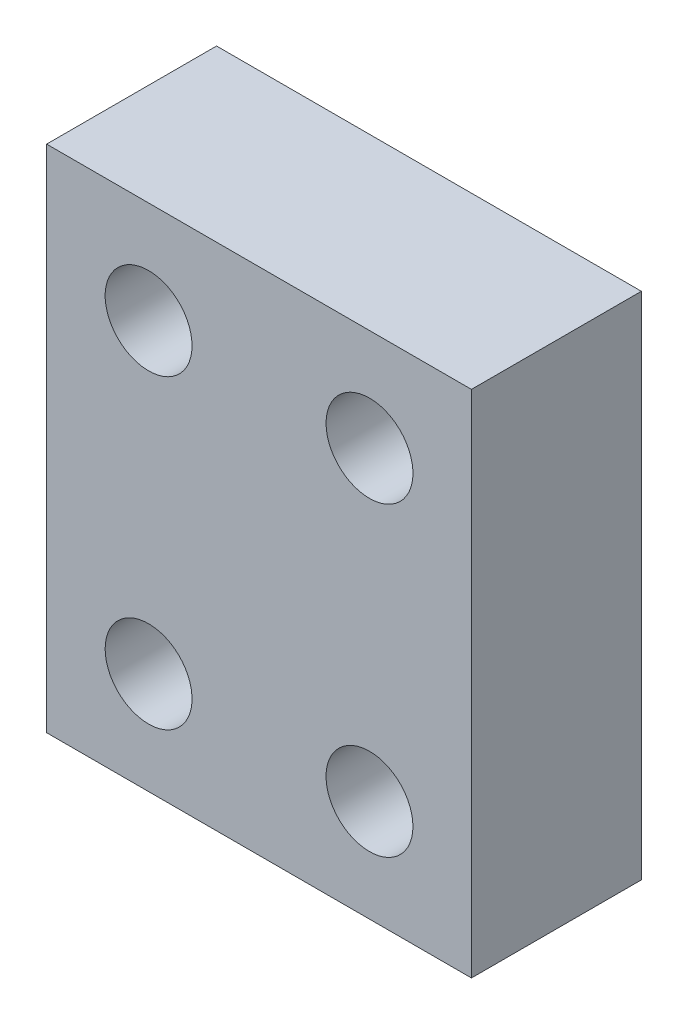
ISO-10303-21;
HEADER;
FILE_DESCRIPTION(('STEP AP214'),'2;1');
FILE_NAME('part.step','',(''),(''),'','','');
FILE_SCHEMA(('AUTOMOTIVE_DESIGN { 1 0 10303 214 1 1 1 1 }'));
ENDSEC;
DATA;
#1=APPLICATION_CONTEXT('core data for automotive mechanical design processes');
#2=APPLICATION_PROTOCOL_DEFINITION('international standard','automotive_design',2000,#1);
#3=PRODUCT_CONTEXT('',#1,'mechanical');
#4=PRODUCT('Part','Part','',(#3));
#5=PRODUCT_RELATED_PRODUCT_CATEGORY('part','',(#4));
#6=PRODUCT_DEFINITION_FORMATION('','',#4);
#7=PRODUCT_DEFINITION_CONTEXT('part definition',#1,'design');
#8=PRODUCT_DEFINITION('design','',#6,#7);
#9=PRODUCT_DEFINITION_SHAPE('','',#8);
#10=(LENGTH_UNIT() NAMED_UNIT(*) SI_UNIT(.MILLI.,.METRE.));
#11=(NAMED_UNIT(*) PLANE_ANGLE_UNIT() SI_UNIT($,.RADIAN.));
#12=(NAMED_UNIT(*) SI_UNIT($,.STERADIAN.) SOLID_ANGLE_UNIT());
#13=UNCERTAINTY_MEASURE_WITH_UNIT(LENGTH_MEASURE(1.E-05),#10,'distance_accuracy_value','');
#14=(GEOMETRIC_REPRESENTATION_CONTEXT(3) GLOBAL_UNCERTAINTY_ASSIGNED_CONTEXT((#13)) GLOBAL_UNIT_ASSIGNED_CONTEXT((#10,
#11,#12)) REPRESENTATION_CONTEXT('',''));
#15=CARTESIAN_POINT('',(0.,0.,0.));
#16=DIRECTION('',(0.,0.,1.));
#17=DIRECTION('',(1.,0.,0.));
#18=AXIS2_PLACEMENT_3D('',#15,#16,#17);
#19=CARTESIAN_POINT('',(0.,0.,10.));
#20=DIRECTION('',(0.,0.,1.));
#21=DIRECTION('',(1.,0.,0.));
#22=AXIS2_PLACEMENT_3D('',#19,#20,#21);
#23=PLANE('',#22);
#24=CARTESIAN_POINT('',(-6.00000000000001,6.00000000000001,10.));
#25=DIRECTION('',(0.,0.,1.));
#26=DIRECTION('',(1.,0.,0.));
#27=AXIS2_PLACEMENT_3D('',#24,#25,#26);
#28=CIRCLE('',#27,2.55684);
#29=CARTESIAN_POINT('',(-3.44316,6.00000000000001,10.));
#30=VERTEX_POINT('',#29);
#31=EDGE_CURVE('E127',#30,#30,#28,.T.);
#32=ORIENTED_EDGE('',*,*,#31,.F.);
#33=EDGE_LOOP('',(#32));
#34=FACE_BOUND('',#33,.T.);
#35=CARTESIAN_POINT('',(-19.,24.,10.));
#36=DIRECTION('',(0.,0.,1.));
#37=DIRECTION('',(1.,0.,0.));
#38=AXIS2_PLACEMENT_3D('',#35,#36,#37);
#39=CIRCLE('',#38,2.55684);
#40=CARTESIAN_POINT('',(-16.44316,24.,10.));
#41=VERTEX_POINT('',#40);
#42=EDGE_CURVE('E106',#41,#41,#39,.T.);
#43=ORIENTED_EDGE('',*,*,#42,.F.);
#44=EDGE_LOOP('',(#43));
#45=FACE_BOUND('',#44,.T.);
#46=DIRECTION('',(0.,1.,0.));
#47=VECTOR('',#46,1.);
#48=CARTESIAN_POINT('',(0.,0.,10.));
#49=LINE('',#48,#47);
#50=CARTESIAN_POINT('',(0.,0.,10.));
#51=VERTEX_POINT('',#50);
#52=CARTESIAN_POINT('',(0.,30.,10.));
#53=VERTEX_POINT('',#52);
#54=EDGE_CURVE('E91',#51,#53,#49,.T.);
#55=ORIENTED_EDGE('',*,*,#54,.T.);
#56=DIRECTION('',(-1.,0.,0.));
#57=VECTOR('',#56,1.);
#58=CARTESIAN_POINT('',(0.,30.,10.));
#59=LINE('',#58,#57);
#60=CARTESIAN_POINT('',(-25.,30.,10.));
#61=VERTEX_POINT('',#60);
#62=EDGE_CURVE('E86',#53,#61,#59,.T.);
#63=ORIENTED_EDGE('',*,*,#62,.T.);
#64=DIRECTION('',(0.,-1.,0.));
#65=VECTOR('',#64,1.);
#66=CARTESIAN_POINT('',(-25.,0.,10.));
#67=LINE('',#66,#65);
#68=CARTESIAN_POINT('',(-25.,0.,10.));
#69=VERTEX_POINT('',#68);
#70=EDGE_CURVE('E89',#61,#69,#67,.T.);
#71=ORIENTED_EDGE('',*,*,#70,.T.);
#72=DIRECTION('',(1.,0.,0.));
#73=VECTOR('',#72,1.);
#74=CARTESIAN_POINT('',(0.,0.,10.));
#75=LINE('',#74,#73);
#76=EDGE_CURVE('E56',#69,#51,#75,.T.);
#77=ORIENTED_EDGE('',*,*,#76,.T.);
#78=EDGE_LOOP('',(#55,#63,#71,#77));
#79=FACE_BOUND('',#78,.T.);
#80=CARTESIAN_POINT('',(-6.00000000000001,24.,10.));
#81=DIRECTION('',(0.,0.,1.));
#82=DIRECTION('',(-1.,0.,0.));
#83=AXIS2_PLACEMENT_3D('',#80,#81,#82);
#84=CIRCLE('',#83,2.55684);
#85=CARTESIAN_POINT('',(-8.55684000000001,24.,10.));
#86=VERTEX_POINT('',#85);
#87=EDGE_CURVE('E121',#86,#86,#84,.T.);
#88=ORIENTED_EDGE('',*,*,#87,.F.);
#89=EDGE_LOOP('',(#88));
#90=FACE_BOUND('',#89,.T.);
#91=CARTESIAN_POINT('',(-19.,6.00000000000001,10.));
#92=DIRECTION('',(0.,0.,1.));
#93=DIRECTION('',(-1.,0.,0.));
#94=AXIS2_PLACEMENT_3D('',#91,#92,#93);
#95=CIRCLE('',#94,2.55684);
#96=CARTESIAN_POINT('',(-21.55684,6.00000000000001,10.));
#97=VERTEX_POINT('',#96);
#98=EDGE_CURVE('E133',#97,#97,#95,.T.);
#99=ORIENTED_EDGE('',*,*,#98,.F.);
#100=EDGE_LOOP('',(#99));
#101=FACE_BOUND('',#100,.T.);
#102=ADVANCED_FACE('F39',(#34,#45,#79,#90,#101),#23,.T.);
#103=CARTESIAN_POINT('',(0.,0.,0.));
#104=DIRECTION('',(0.,0.,1.));
#105=DIRECTION('',(1.,0.,0.));
#106=AXIS2_PLACEMENT_3D('',#103,#104,#105);
#107=PLANE('',#106);
#108=DIRECTION('',(0.,1.,0.));
#109=VECTOR('',#108,1.);
#110=CARTESIAN_POINT('',(0.,0.,0.));
#111=LINE('',#110,#109);
#112=CARTESIAN_POINT('',(0.,0.,0.));
#113=VERTEX_POINT('',#112);
#114=CARTESIAN_POINT('',(0.,30.,0.));
#115=VERTEX_POINT('',#114);
#116=EDGE_CURVE('E103',#113,#115,#111,.T.);
#117=ORIENTED_EDGE('',*,*,#116,.F.);
#118=DIRECTION('',(1.,0.,0.));
#119=VECTOR('',#118,1.);
#120=CARTESIAN_POINT('',(0.,0.,0.));
#121=LINE('',#120,#119);
#122=CARTESIAN_POINT('',(-25.,0.,0.));
#123=VERTEX_POINT('',#122);
#124=EDGE_CURVE('E79',#123,#113,#121,.T.);
#125=ORIENTED_EDGE('',*,*,#124,.F.);
#126=DIRECTION('',(0.,-1.,0.));
#127=VECTOR('',#126,1.);
#128=CARTESIAN_POINT('',(-25.,0.,0.));
#129=LINE('',#128,#127);
#130=CARTESIAN_POINT('',(-25.,30.,0.));
#131=VERTEX_POINT('',#130);
#132=EDGE_CURVE('E73',#131,#123,#129,.T.);
#133=ORIENTED_EDGE('',*,*,#132,.F.);
#134=DIRECTION('',(-1.,0.,0.));
#135=VECTOR('',#134,1.);
#136=CARTESIAN_POINT('',(0.,30.,0.));
#137=LINE('',#136,#135);
#138=EDGE_CURVE('E95',#115,#131,#137,.T.);
#139=ORIENTED_EDGE('',*,*,#138,.F.);
#140=EDGE_LOOP('',(#117,#125,#133,#139));
#141=FACE_BOUND('',#140,.T.);
#142=CARTESIAN_POINT('',(-19.,24.,0.));
#143=DIRECTION('',(0.,0.,1.));
#144=DIRECTION('',(1.,0.,0.));
#145=AXIS2_PLACEMENT_3D('',#142,#143,#144);
#146=CIRCLE('',#145,2.55684);
#147=CARTESIAN_POINT('',(-16.44316,24.,0.));
#148=VERTEX_POINT('',#147);
#149=EDGE_CURVE('E118',#148,#148,#146,.T.);
#150=ORIENTED_EDGE('',*,*,#149,.T.);
#151=EDGE_LOOP('',(#150));
#152=FACE_BOUND('',#151,.T.);
#153=CARTESIAN_POINT('',(-6.00000000000001,24.,0.));
#154=DIRECTION('',(0.,0.,1.));
#155=DIRECTION('',(-1.,0.,0.));
#156=AXIS2_PLACEMENT_3D('',#153,#154,#155);
#157=CIRCLE('',#156,2.55684);
#158=CARTESIAN_POINT('',(-8.55684000000001,24.,0.));
#159=VERTEX_POINT('',#158);
#160=EDGE_CURVE('E124',#159,#159,#157,.T.);
#161=ORIENTED_EDGE('',*,*,#160,.T.);
#162=EDGE_LOOP('',(#161));
#163=FACE_BOUND('',#162,.T.);
#164=CARTESIAN_POINT('',(-6.00000000000001,6.00000000000001,0.));
#165=DIRECTION('',(0.,0.,1.));
#166=DIRECTION('',(1.,0.,0.));
#167=AXIS2_PLACEMENT_3D('',#164,#165,#166);
#168=CIRCLE('',#167,2.55684);
#169=CARTESIAN_POINT('',(-3.44316,6.00000000000001,0.));
#170=VERTEX_POINT('',#169);
#171=EDGE_CURVE('E130',#170,#170,#168,.T.);
#172=ORIENTED_EDGE('',*,*,#171,.T.);
#173=EDGE_LOOP('',(#172));
#174=FACE_BOUND('',#173,.T.);
#175=CARTESIAN_POINT('',(-19.,6.00000000000001,0.));
#176=DIRECTION('',(0.,0.,1.));
#177=DIRECTION('',(-1.,0.,0.));
#178=AXIS2_PLACEMENT_3D('',#175,#176,#177);
#179=CIRCLE('',#178,2.55684);
#180=CARTESIAN_POINT('',(-21.55684,6.00000000000001,0.));
#181=VERTEX_POINT('',#180);
#182=EDGE_CURVE('E136',#181,#181,#179,.T.);
#183=ORIENTED_EDGE('',*,*,#182,.T.);
#184=EDGE_LOOP('',(#183));
#185=FACE_BOUND('',#184,.T.);
#186=ADVANCED_FACE('F114',(#141,#152,#163,#174,#185),#107,.F.);
#187=CARTESIAN_POINT('',(0.,0.,10.));
#188=DIRECTION('',(-1.,0.,0.));
#189=DIRECTION('',(0.,0.,1.));
#190=AXIS2_PLACEMENT_3D('',#187,#188,#189);
#191=PLANE('',#190);
#192=ORIENTED_EDGE('',*,*,#116,.T.);
#193=DIRECTION('',(0.,0.,-1.));
#194=VECTOR('',#193,1.);
#195=CARTESIAN_POINT('',(0.,30.,10.));
#196=LINE('',#195,#194);
#197=EDGE_CURVE('E11',#53,#115,#196,.T.);
#198=ORIENTED_EDGE('',*,*,#197,.F.);
#199=ORIENTED_EDGE('',*,*,#54,.F.);
#200=DIRECTION('',(0.,0.,-1.));
#201=VECTOR('',#200,1.);
#202=CARTESIAN_POINT('',(0.,0.,10.));
#203=LINE('',#202,#201);
#204=EDGE_CURVE('E99',#51,#113,#203,.T.);
#205=ORIENTED_EDGE('',*,*,#204,.T.);
#206=EDGE_LOOP('',(#192,#198,#199,#205));
#207=FACE_BOUND('',#206,.T.);
#208=ADVANCED_FACE('F41',(#207),#191,.F.);
#209=CARTESIAN_POINT('',(0.,30.,10.));
#210=DIRECTION('',(0.,-1.,0.));
#211=DIRECTION('',(1.,0.,0.));
#212=AXIS2_PLACEMENT_3D('',#209,#210,#211);
#213=PLANE('',#212);
#214=ORIENTED_EDGE('',*,*,#138,.T.);
#215=DIRECTION('',(0.,0.,-1.));
#216=VECTOR('',#215,1.);
#217=CARTESIAN_POINT('',(-25.,30.,10.));
#218=LINE('',#217,#216);
#219=EDGE_CURVE('E48',#61,#131,#218,.T.);
#220=ORIENTED_EDGE('',*,*,#219,.F.);
#221=ORIENTED_EDGE('',*,*,#62,.F.);
#222=ORIENTED_EDGE('',*,*,#197,.T.);
#223=EDGE_LOOP('',(#214,#220,#221,#222));
#224=FACE_BOUND('',#223,.T.);
#225=ADVANCED_FACE('F94',(#224),#213,.F.);
#226=CARTESIAN_POINT('',(-25.,0.,10.));
#227=DIRECTION('',(1.,0.,0.));
#228=DIRECTION('',(0.,0.,-1.));
#229=AXIS2_PLACEMENT_3D('',#226,#227,#228);
#230=PLANE('',#229);
#231=ORIENTED_EDGE('',*,*,#132,.T.);
#232=DIRECTION('',(0.,0.,-1.));
#233=VECTOR('',#232,1.);
#234=CARTESIAN_POINT('',(-25.,0.,10.));
#235=LINE('',#234,#233);
#236=EDGE_CURVE('E96',#69,#123,#235,.T.);
#237=ORIENTED_EDGE('',*,*,#236,.F.);
#238=ORIENTED_EDGE('',*,*,#70,.F.);
#239=ORIENTED_EDGE('',*,*,#219,.T.);
#240=EDGE_LOOP('',(#231,#237,#238,#239));
#241=FACE_BOUND('',#240,.T.);
#242=ADVANCED_FACE('F97',(#241),#230,.F.);
#243=CARTESIAN_POINT('',(0.,0.,10.));
#244=DIRECTION('',(0.,1.,0.));
#245=DIRECTION('',(-1.,0.,0.));
#246=AXIS2_PLACEMENT_3D('',#243,#244,#245);
#247=PLANE('',#246);
#248=ORIENTED_EDGE('',*,*,#124,.T.);
#249=ORIENTED_EDGE('',*,*,#204,.F.);
#250=ORIENTED_EDGE('',*,*,#76,.F.);
#251=ORIENTED_EDGE('',*,*,#236,.T.);
#252=EDGE_LOOP('',(#248,#249,#250,#251));
#253=FACE_BOUND('',#252,.T.);
#254=ADVANCED_FACE('F111',(#253),#247,.F.);
#255=CARTESIAN_POINT('',(-19.,24.,10.));
#256=DIRECTION('',(0.,0.,-1.));
#257=DIRECTION('',(-1.,0.,0.));
#258=AXIS2_PLACEMENT_3D('',#255,#256,#257);
#259=CYLINDRICAL_SURFACE('',#258,2.55684);
#260=ORIENTED_EDGE('',*,*,#42,.T.);
#261=EDGE_LOOP('',(#260));
#262=FACE_BOUND('',#261,.T.);
#263=ORIENTED_EDGE('',*,*,#149,.F.);
#264=EDGE_LOOP('',(#263));
#265=FACE_BOUND('',#264,.T.);
#266=ADVANCED_FACE('F155',(#262,#265),#259,.F.);
#267=CARTESIAN_POINT('',(-6.00000000000001,24.,10.));
#268=DIRECTION('',(0.,0.,-1.));
#269=DIRECTION('',(-1.,0.,0.));
#270=AXIS2_PLACEMENT_3D('',#267,#268,#269);
#271=CYLINDRICAL_SURFACE('',#270,2.55684);
#272=ORIENTED_EDGE('',*,*,#87,.T.);
#273=EDGE_LOOP('',(#272));
#274=FACE_BOUND('',#273,.T.);
#275=ORIENTED_EDGE('',*,*,#160,.F.);
#276=EDGE_LOOP('',(#275));
#277=FACE_BOUND('',#276,.T.);
#278=ADVANCED_FACE('F200',(#274,#277),#271,.F.);
#279=CARTESIAN_POINT('',(-6.00000000000001,6.00000000000001,10.));
#280=DIRECTION('',(0.,0.,-1.));
#281=DIRECTION('',(-1.,0.,0.));
#282=AXIS2_PLACEMENT_3D('',#279,#280,#281);
#283=CYLINDRICAL_SURFACE('',#282,2.55684);
#284=ORIENTED_EDGE('',*,*,#31,.T.);
#285=EDGE_LOOP('',(#284));
#286=FACE_BOUND('',#285,.T.);
#287=ORIENTED_EDGE('',*,*,#171,.F.);
#288=EDGE_LOOP('',(#287));
#289=FACE_BOUND('',#288,.T.);
#290=ADVANCED_FACE('F208',(#286,#289),#283,.F.);
#291=CARTESIAN_POINT('',(-19.,6.00000000000001,10.));
#292=DIRECTION('',(0.,0.,-1.));
#293=DIRECTION('',(-1.,0.,0.));
#294=AXIS2_PLACEMENT_3D('',#291,#292,#293);
#295=CYLINDRICAL_SURFACE('',#294,2.55684);
#296=ORIENTED_EDGE('',*,*,#98,.T.);
#297=EDGE_LOOP('',(#296));
#298=FACE_BOUND('',#297,.T.);
#299=ORIENTED_EDGE('',*,*,#182,.F.);
#300=EDGE_LOOP('',(#299));
#301=FACE_BOUND('',#300,.T.);
#302=ADVANCED_FACE('F142',(#298,#301),#295,.F.);
#303=CLOSED_SHELL('',(#102,#186,#208,#225,#242,#254,#266,#278,#290,#302));
#304=MANIFOLD_SOLID_BREP('B2',#303);
#305=ADVANCED_BREP_SHAPE_REPRESENTATION('',(#18,#304),#14);
#306=SHAPE_DEFINITION_REPRESENTATION(#9,#305);
ENDSEC;
END-ISO-10303-21;
